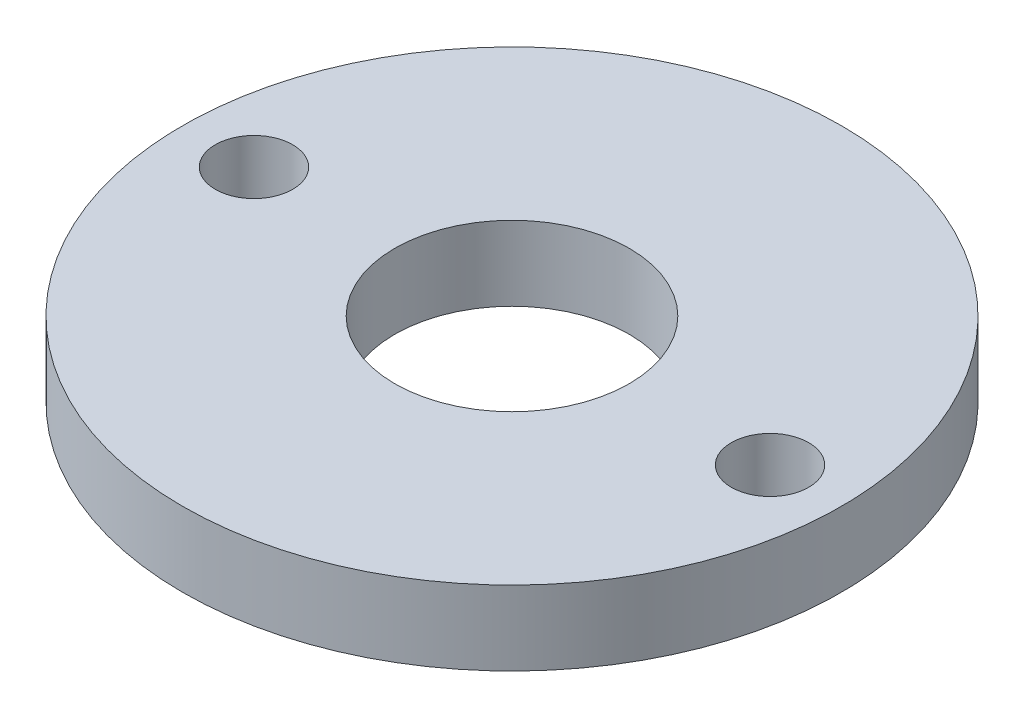
ISO-10303-21;
HEADER;
FILE_DESCRIPTION(('STEP AP214'),'2;1');
FILE_NAME('part.step','',(''),(''),'','','');
FILE_SCHEMA(('AUTOMOTIVE_DESIGN { 1 0 10303 214 1 1 1 1 }'));
ENDSEC;
DATA;
#1=APPLICATION_CONTEXT('core data for automotive mechanical design processes');
#2=APPLICATION_PROTOCOL_DEFINITION('international standard','automotive_design',2000,#1);
#3=PRODUCT_CONTEXT('',#1,'mechanical');
#4=PRODUCT('Part','Part','',(#3));
#5=PRODUCT_RELATED_PRODUCT_CATEGORY('part','',(#4));
#6=PRODUCT_DEFINITION_FORMATION('','',#4);
#7=PRODUCT_DEFINITION_CONTEXT('part definition',#1,'design');
#8=PRODUCT_DEFINITION('design','',#6,#7);
#9=PRODUCT_DEFINITION_SHAPE('','',#8);
#10=(LENGTH_UNIT() NAMED_UNIT(*) SI_UNIT(.MILLI.,.METRE.));
#11=(NAMED_UNIT(*) PLANE_ANGLE_UNIT() SI_UNIT($,.RADIAN.));
#12=(NAMED_UNIT(*) SI_UNIT($,.STERADIAN.) SOLID_ANGLE_UNIT());
#13=UNCERTAINTY_MEASURE_WITH_UNIT(LENGTH_MEASURE(1.E-05),#10,'distance_accuracy_value','');
#14=(GEOMETRIC_REPRESENTATION_CONTEXT(3) GLOBAL_UNCERTAINTY_ASSIGNED_CONTEXT((#13)) GLOBAL_UNIT_ASSIGNED_CONTEXT((#10,
#11,#12)) REPRESENTATION_CONTEXT('',''));
#15=CARTESIAN_POINT('',(0.,0.,0.));
#16=DIRECTION('',(0.,0.,1.));
#17=DIRECTION('',(1.,0.,0.));
#18=AXIS2_PLACEMENT_3D('',#15,#16,#17);
#19=CARTESIAN_POINT('',(0.,3.175,0.));
#20=DIRECTION('',(0.,1.,0.));
#21=DIRECTION('',(0.,0.,1.));
#22=AXIS2_PLACEMENT_3D('',#19,#20,#21);
#23=PLANE('',#22);
#24=CARTESIAN_POINT('',(11.,3.175,0.));
#25=DIRECTION('',(0.,1.,0.));
#26=DIRECTION('',(0.,0.,1.));
#27=AXIS2_PLACEMENT_3D('',#24,#25,#26);
#28=CIRCLE('',#27,1.65);
#29=CARTESIAN_POINT('',(11.,3.175,1.65));
#30=VERTEX_POINT('',#29);
#31=EDGE_CURVE('E55',#30,#30,#28,.T.);
#32=ORIENTED_EDGE('',*,*,#31,.F.);
#33=EDGE_LOOP('',(#32));
#34=FACE_BOUND('',#33,.T.);
#35=CARTESIAN_POINT('',(0.,3.175,0.));
#36=DIRECTION('',(0.,1.,0.));
#37=DIRECTION('',(0.,0.,1.));
#38=AXIS2_PLACEMENT_3D('',#35,#36,#37);
#39=CIRCLE('',#38,14.05);
#40=CARTESIAN_POINT('',(0.,3.175,14.05));
#41=VERTEX_POINT('',#40);
#42=EDGE_CURVE('E10',#41,#41,#39,.T.);
#43=ORIENTED_EDGE('',*,*,#42,.T.);
#44=EDGE_LOOP('',(#43));
#45=FACE_BOUND('',#44,.T.);
#46=CARTESIAN_POINT('',(0.,3.175,0.));
#47=DIRECTION('',(0.,1.,0.));
#48=DIRECTION('',(0.,0.,1.));
#49=AXIS2_PLACEMENT_3D('',#46,#47,#48);
#50=CIRCLE('',#49,5.);
#51=CARTESIAN_POINT('',(0.,3.175,5.));
#52=VERTEX_POINT('',#51);
#53=EDGE_CURVE('E50',#52,#52,#50,.T.);
#54=ORIENTED_EDGE('',*,*,#53,.F.);
#55=EDGE_LOOP('',(#54));
#56=FACE_BOUND('',#55,.T.);
#57=CARTESIAN_POINT('',(-11.,3.175,0.));
#58=DIRECTION('',(0.,1.,0.));
#59=DIRECTION('',(0.,0.,1.));
#60=AXIS2_PLACEMENT_3D('',#57,#58,#59);
#61=CIRCLE('',#60,1.65);
#62=CARTESIAN_POINT('',(-11.,3.175,1.65));
#63=VERTEX_POINT('',#62);
#64=EDGE_CURVE('E61',#63,#63,#61,.T.);
#65=ORIENTED_EDGE('',*,*,#64,.F.);
#66=EDGE_LOOP('',(#65));
#67=FACE_BOUND('',#66,.T.);
#68=ADVANCED_FACE('F39',(#34,#45,#56,#67),#23,.T.);
#69=CARTESIAN_POINT('',(0.,0.,0.));
#70=DIRECTION('',(0.,1.,0.));
#71=DIRECTION('',(0.,0.,1.));
#72=AXIS2_PLACEMENT_3D('',#69,#70,#71);
#73=PLANE('',#72);
#74=CARTESIAN_POINT('',(0.,0.,0.));
#75=DIRECTION('',(0.,1.,0.));
#76=DIRECTION('',(0.,0.,1.));
#77=AXIS2_PLACEMENT_3D('',#74,#75,#76);
#78=CIRCLE('',#77,14.05);
#79=CARTESIAN_POINT('',(0.,0.,14.05));
#80=VERTEX_POINT('',#79);
#81=EDGE_CURVE('E43',#80,#80,#78,.T.);
#82=ORIENTED_EDGE('',*,*,#81,.F.);
#83=EDGE_LOOP('',(#82));
#84=FACE_BOUND('',#83,.T.);
#85=CARTESIAN_POINT('',(0.,0.,0.));
#86=DIRECTION('',(0.,1.,0.));
#87=DIRECTION('',(0.,0.,1.));
#88=AXIS2_PLACEMENT_3D('',#85,#86,#87);
#89=CIRCLE('',#88,5.);
#90=CARTESIAN_POINT('',(0.,0.,5.));
#91=VERTEX_POINT('',#90);
#92=EDGE_CURVE('E52',#91,#91,#89,.T.);
#93=ORIENTED_EDGE('',*,*,#92,.T.);
#94=EDGE_LOOP('',(#93));
#95=FACE_BOUND('',#94,.T.);
#96=CARTESIAN_POINT('',(11.,0.,0.));
#97=DIRECTION('',(0.,1.,0.));
#98=DIRECTION('',(0.,0.,1.));
#99=AXIS2_PLACEMENT_3D('',#96,#97,#98);
#100=CIRCLE('',#99,1.65);
#101=CARTESIAN_POINT('',(11.,0.,1.65));
#102=VERTEX_POINT('',#101);
#103=EDGE_CURVE('E58',#102,#102,#100,.T.);
#104=ORIENTED_EDGE('',*,*,#103,.T.);
#105=EDGE_LOOP('',(#104));
#106=FACE_BOUND('',#105,.T.);
#107=CARTESIAN_POINT('',(-11.,0.,0.));
#108=DIRECTION('',(0.,1.,0.));
#109=DIRECTION('',(0.,0.,1.));
#110=AXIS2_PLACEMENT_3D('',#107,#108,#109);
#111=CIRCLE('',#110,1.65);
#112=CARTESIAN_POINT('',(-11.,0.,1.65));
#113=VERTEX_POINT('',#112);
#114=EDGE_CURVE('E64',#113,#113,#111,.T.);
#115=ORIENTED_EDGE('',*,*,#114,.T.);
#116=EDGE_LOOP('',(#115));
#117=FACE_BOUND('',#116,.T.);
#118=ADVANCED_FACE('F74',(#84,#95,#106,#117),#73,.F.);
#119=CARTESIAN_POINT('',(0.,3.175,0.));
#120=DIRECTION('',(0.,-1.,0.));
#121=DIRECTION('',(0.,0.,-1.));
#122=AXIS2_PLACEMENT_3D('',#119,#120,#121);
#123=CYLINDRICAL_SURFACE('',#122,14.05);
#124=ORIENTED_EDGE('',*,*,#42,.F.);
#125=EDGE_LOOP('',(#124));
#126=FACE_BOUND('',#125,.T.);
#127=ORIENTED_EDGE('',*,*,#81,.T.);
#128=EDGE_LOOP('',(#127));
#129=FACE_BOUND('',#128,.T.);
#130=ADVANCED_FACE('F41',(#126,#129),#123,.T.);
#131=CARTESIAN_POINT('',(0.,3.175,0.));
#132=DIRECTION('',(0.,-1.,0.));
#133=DIRECTION('',(0.,0.,-1.));
#134=AXIS2_PLACEMENT_3D('',#131,#132,#133);
#135=CYLINDRICAL_SURFACE('',#134,5.);
#136=ORIENTED_EDGE('',*,*,#53,.T.);
#137=EDGE_LOOP('',(#136));
#138=FACE_BOUND('',#137,.T.);
#139=ORIENTED_EDGE('',*,*,#92,.F.);
#140=EDGE_LOOP('',(#139));
#141=FACE_BOUND('',#140,.T.);
#142=ADVANCED_FACE('F83',(#138,#141),#135,.F.);
#143=CARTESIAN_POINT('',(11.,3.175,0.));
#144=DIRECTION('',(0.,-1.,0.));
#145=DIRECTION('',(0.,0.,-1.));
#146=AXIS2_PLACEMENT_3D('',#143,#144,#145);
#147=CYLINDRICAL_SURFACE('',#146,1.65);
#148=ORIENTED_EDGE('',*,*,#31,.T.);
#149=EDGE_LOOP('',(#148));
#150=FACE_BOUND('',#149,.T.);
#151=ORIENTED_EDGE('',*,*,#103,.F.);
#152=EDGE_LOOP('',(#151));
#153=FACE_BOUND('',#152,.T.);
#154=ADVANCED_FACE('F86',(#150,#153),#147,.F.);
#155=CARTESIAN_POINT('',(-11.,3.175,0.));
#156=DIRECTION('',(0.,-1.,0.));
#157=DIRECTION('',(0.,0.,-1.));
#158=AXIS2_PLACEMENT_3D('',#155,#156,#157);
#159=CYLINDRICAL_SURFACE('',#158,1.65);
#160=ORIENTED_EDGE('',*,*,#64,.T.);
#161=EDGE_LOOP('',(#160));
#162=FACE_BOUND('',#161,.T.);
#163=ORIENTED_EDGE('',*,*,#114,.F.);
#164=EDGE_LOOP('',(#163));
#165=FACE_BOUND('',#164,.T.);
#166=ADVANCED_FACE('F70',(#162,#165),#159,.F.);
#167=CLOSED_SHELL('',(#68,#118,#130,#142,#154,#166));
#168=MANIFOLD_SOLID_BREP('B2',#167);
#169=ADVANCED_BREP_SHAPE_REPRESENTATION('',(#18,#168),#14);
#170=SHAPE_DEFINITION_REPRESENTATION(#9,#169);
ENDSEC;
END-ISO-10303-21;
